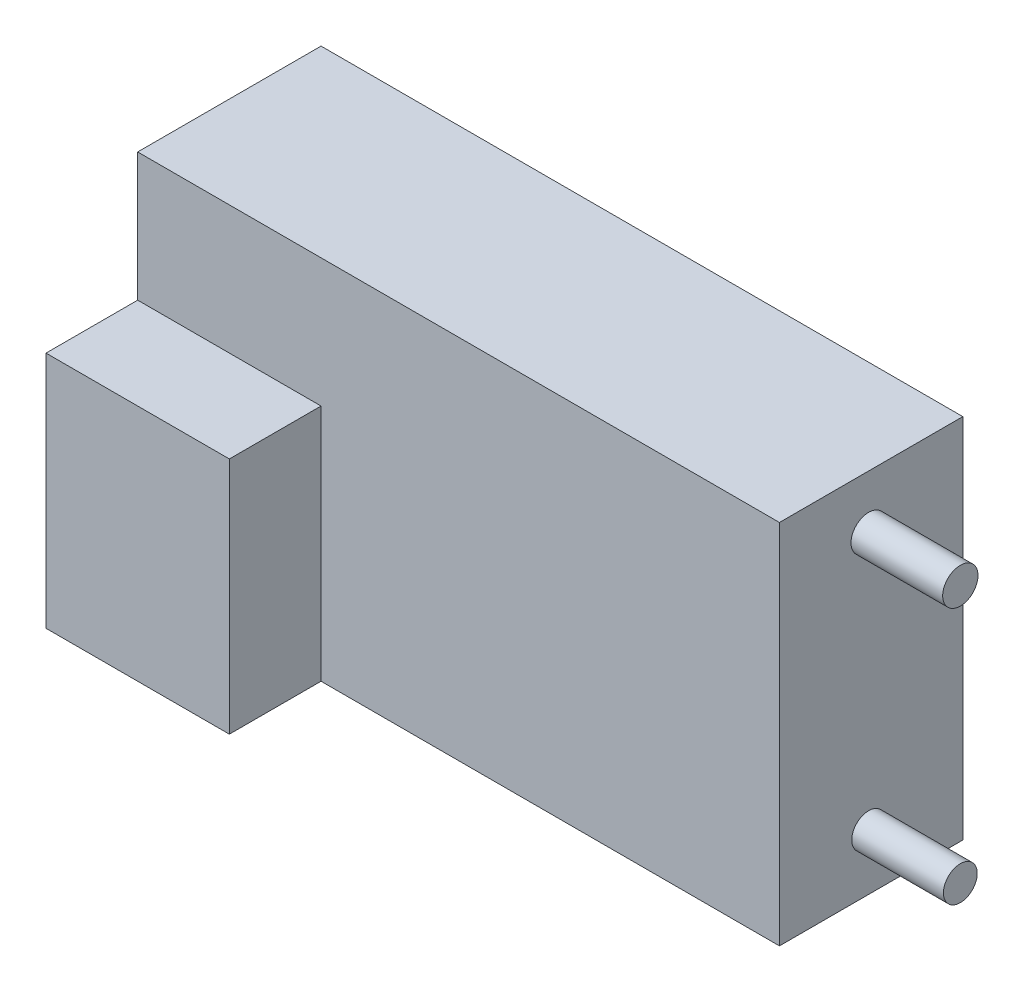
ISO-10303-21;
HEADER;
FILE_DESCRIPTION(('STEP AP214'),'2;1');
FILE_NAME('part.step','',(''),(''),'','','');
FILE_SCHEMA(('AUTOMOTIVE_DESIGN { 1 0 10303 214 1 1 1 1 }'));
ENDSEC;
DATA;
#1=APPLICATION_CONTEXT('core data for automotive mechanical design processes');
#2=APPLICATION_PROTOCOL_DEFINITION('international standard','automotive_design',2000,#1);
#3=PRODUCT_CONTEXT('',#1,'mechanical');
#4=PRODUCT('Part','Part','',(#3));
#5=PRODUCT_RELATED_PRODUCT_CATEGORY('part','',(#4));
#6=PRODUCT_DEFINITION_FORMATION('','',#4);
#7=PRODUCT_DEFINITION_CONTEXT('part definition',#1,'design');
#8=PRODUCT_DEFINITION('design','',#6,#7);
#9=PRODUCT_DEFINITION_SHAPE('','',#8);
#10=(LENGTH_UNIT() NAMED_UNIT(*) SI_UNIT(.MILLI.,.METRE.));
#11=(NAMED_UNIT(*) PLANE_ANGLE_UNIT() SI_UNIT($,.RADIAN.));
#12=(NAMED_UNIT(*) SI_UNIT($,.STERADIAN.) SOLID_ANGLE_UNIT());
#13=UNCERTAINTY_MEASURE_WITH_UNIT(LENGTH_MEASURE(1.E-05),#10,'distance_accuracy_value','');
#14=(GEOMETRIC_REPRESENTATION_CONTEXT(3) GLOBAL_UNCERTAINTY_ASSIGNED_CONTEXT((#13)) GLOBAL_UNIT_ASSIGNED_CONTEXT((#10,
#11,#12)) REPRESENTATION_CONTEXT('',''));
#15=CARTESIAN_POINT('',(0.,0.,0.));
#16=DIRECTION('',(0.,0.,1.));
#17=DIRECTION('',(1.,0.,0.));
#18=AXIS2_PLACEMENT_3D('',#15,#16,#17);
#19=CARTESIAN_POINT('',(18.7257098679594,10.6667758903759,10.));
#20=DIRECTION('',(-1.,0.,0.));
#21=DIRECTION('',(0.,-1.,0.));
#22=AXIS2_PLACEMENT_3D('',#19,#20,#21);
#23=PLANE('',#22);
#24=CARTESIAN_POINT('',(18.7257098679594,-6.30116980363482,5.13508620954894));
#25=DIRECTION('',(-1.,0.,0.));
#26=DIRECTION('',(0.,-1.,0.));
#27=AXIS2_PLACEMENT_3D('',#24,#25,#26);
#28=CIRCLE('',#27,0.92212142849435);
#29=CARTESIAN_POINT('',(18.7257098679594,-7.22329123212917,5.13508620954894));
#30=VERTEX_POINT('',#29);
#31=EDGE_CURVE('E45',#30,#30,#28,.F.);
#32=ORIENTED_EDGE('',*,*,#31,.F.);
#33=EDGE_LOOP('',(#32));
#34=FACE_BOUND('',#33,.T.);
#35=DIRECTION('',(0.,1.,0.));
#36=VECTOR('',#35,1.);
#37=CARTESIAN_POINT('',(18.7257098679594,10.6667758903759,0.));
#38=LINE('',#37,#36);
#39=CARTESIAN_POINT('',(18.7257098679594,-9.33322410962413,0.));
#40=VERTEX_POINT('',#39);
#41=CARTESIAN_POINT('',(18.7257098679594,10.6667758903759,0.));
#42=VERTEX_POINT('',#41);
#43=EDGE_CURVE('E152',#40,#42,#38,.T.);
#44=ORIENTED_EDGE('',*,*,#43,.T.);
#45=DIRECTION('',(0.,0.,-1.));
#46=VECTOR('',#45,1.);
#47=CARTESIAN_POINT('',(18.7257098679594,10.6667758903759,10.));
#48=LINE('',#47,#46);
#49=CARTESIAN_POINT('',(18.7257098679594,10.6667758903759,10.));
#50=VERTEX_POINT('',#49);
#51=EDGE_CURVE('E284',#50,#42,#48,.T.);
#52=ORIENTED_EDGE('',*,*,#51,.F.);
#53=DIRECTION('',(0.,1.,0.));
#54=VECTOR('',#53,1.);
#55=CARTESIAN_POINT('',(18.7257098679594,10.6667758903759,10.));
#56=LINE('',#55,#54);
#57=CARTESIAN_POINT('',(18.7257098679594,-9.33322410962413,10.));
#58=VERTEX_POINT('',#57);
#59=EDGE_CURVE('E303',#58,#50,#56,.T.);
#60=ORIENTED_EDGE('',*,*,#59,.F.);
#61=DIRECTION('',(0.,0.,-1.));
#62=VECTOR('',#61,1.);
#63=CARTESIAN_POINT('',(18.7257098679594,-9.33322410962413,10.));
#64=LINE('',#63,#62);
#65=EDGE_CURVE('E105',#58,#40,#64,.T.);
#66=ORIENTED_EDGE('',*,*,#65,.T.);
#67=EDGE_LOOP('',(#44,#52,#60,#66));
#68=FACE_BOUND('',#67,.T.);
#69=CARTESIAN_POINT('',(18.7257098679594,7.75028685558255,5.13508620954894));
#70=DIRECTION('',(-1.,0.,0.));
#71=DIRECTION('',(0.,-1.,0.));
#72=AXIS2_PLACEMENT_3D('',#69,#70,#71);
#73=CIRCLE('',#72,0.963466346751914);
#74=CARTESIAN_POINT('',(18.7257098679594,6.78682050883063,5.13508620954894));
#75=VERTEX_POINT('',#74);
#76=EDGE_CURVE('E11',#75,#75,#73,.F.);
#77=ORIENTED_EDGE('',*,*,#76,.F.);
#78=EDGE_LOOP('',(#77));
#79=FACE_BOUND('',#78,.T.);
#80=ADVANCED_FACE('F37',(#34,#68,#79),#23,.F.);
#81=CARTESIAN_POINT('',(-16.2742901320406,10.6667758903759,10.));
#82=DIRECTION('',(1.,0.,0.));
#83=DIRECTION('',(0.,0.,-1.));
#84=AXIS2_PLACEMENT_3D('',#81,#82,#83);
#85=PLANE('',#84);
#86=DIRECTION('',(0.,-1.,0.));
#87=VECTOR('',#86,1.);
#88=CARTESIAN_POINT('',(-16.2742901320406,10.6667758903759,0.));
#89=LINE('',#88,#87);
#90=CARTESIAN_POINT('',(-16.2742901320406,10.6667758903759,0.));
#91=VERTEX_POINT('',#90);
#92=CARTESIAN_POINT('',(-16.2742901320406,-9.33322410962413,0.));
#93=VERTEX_POINT('',#92);
#94=EDGE_CURVE('E103',#91,#93,#89,.T.);
#95=ORIENTED_EDGE('',*,*,#94,.T.);
#96=DIRECTION('',(0.,0.,-1.));
#97=VECTOR('',#96,1.);
#98=CARTESIAN_POINT('',(-16.2742901320406,-9.33322410962413,10.));
#99=LINE('',#98,#97);
#100=CARTESIAN_POINT('',(-16.2742901320406,-9.33322410962413,15.));
#101=VERTEX_POINT('',#100);
#102=EDGE_CURVE('E96',#101,#93,#99,.T.);
#103=ORIENTED_EDGE('',*,*,#102,.F.);
#104=DIRECTION('',(0.,-1.,0.));
#105=VECTOR('',#104,1.);
#106=CARTESIAN_POINT('',(-16.2742901320406,-9.33322410962413,15.));
#107=LINE('',#106,#105);
#108=CARTESIAN_POINT('',(-16.2742901320406,3.66677589037587,15.));
#109=VERTEX_POINT('',#108);
#110=EDGE_CURVE('E100',#109,#101,#107,.T.);
#111=ORIENTED_EDGE('',*,*,#110,.F.);
#112=DIRECTION('',(0.,0.,-1.));
#113=VECTOR('',#112,1.);
#114=CARTESIAN_POINT('',(-16.2742901320406,3.66677589037587,15.));
#115=LINE('',#114,#113);
#116=CARTESIAN_POINT('',(-16.2742901320406,3.66677589037587,10.));
#117=VERTEX_POINT('',#116);
#118=EDGE_CURVE('E129',#109,#117,#115,.T.);
#119=ORIENTED_EDGE('',*,*,#118,.T.);
#120=DIRECTION('',(0.,-1.,0.));
#121=VECTOR('',#120,1.);
#122=CARTESIAN_POINT('',(-16.2742901320406,10.6667758903759,10.));
#123=LINE('',#122,#121);
#124=CARTESIAN_POINT('',(-16.2742901320406,10.6667758903759,10.));
#125=VERTEX_POINT('',#124);
#126=EDGE_CURVE('E58',#125,#117,#123,.T.);
#127=ORIENTED_EDGE('',*,*,#126,.F.);
#128=DIRECTION('',(0.,0.,-1.));
#129=VECTOR('',#128,1.);
#130=CARTESIAN_POINT('',(-16.2742901320406,10.6667758903759,10.));
#131=LINE('',#130,#129);
#132=EDGE_CURVE('E283',#125,#91,#131,.T.);
#133=ORIENTED_EDGE('',*,*,#132,.T.);
#134=EDGE_LOOP('',(#95,#103,#111,#119,#127,#133));
#135=FACE_BOUND('',#134,.T.);
#136=ADVANCED_FACE('F39',(#135),#85,.F.);
#137=CARTESIAN_POINT('',(-16.2742901320406,-9.33322410962413,10.));
#138=DIRECTION('',(0.,1.,0.));
#139=DIRECTION('',(0.,0.,1.));
#140=AXIS2_PLACEMENT_3D('',#137,#138,#139);
#141=PLANE('',#140);
#142=DIRECTION('',(1.,0.,0.));
#143=VECTOR('',#142,1.);
#144=CARTESIAN_POINT('',(-16.2742901320406,-9.33322410962413,0.));
#145=LINE('',#144,#143);
#146=EDGE_CURVE('E288',#93,#40,#145,.T.);
#147=ORIENTED_EDGE('',*,*,#146,.T.);
#148=ORIENTED_EDGE('',*,*,#65,.F.);
#149=DIRECTION('',(1.,0.,0.));
#150=VECTOR('',#149,1.);
#151=CARTESIAN_POINT('',(-16.2742901320406,-9.33322410962413,10.));
#152=LINE('',#151,#150);
#153=CARTESIAN_POINT('',(-6.27429013204058,-9.33322410962413,10.));
#154=VERTEX_POINT('',#153);
#155=EDGE_CURVE('E298',#154,#58,#152,.T.);
#156=ORIENTED_EDGE('',*,*,#155,.F.);
#157=DIRECTION('',(0.,0.,-1.));
#158=VECTOR('',#157,1.);
#159=CARTESIAN_POINT('',(-6.27429013204058,-9.33322410962413,15.));
#160=LINE('',#159,#158);
#161=CARTESIAN_POINT('',(-6.27429013204058,-9.33322410962413,15.));
#162=VERTEX_POINT('',#161);
#163=EDGE_CURVE('E111',#162,#154,#160,.T.);
#164=ORIENTED_EDGE('',*,*,#163,.F.);
#165=DIRECTION('',(1.,0.,0.));
#166=VECTOR('',#165,1.);
#167=CARTESIAN_POINT('',(-16.2742901320406,-9.33322410962413,15.));
#168=LINE('',#167,#166);
#169=EDGE_CURVE('E108',#101,#162,#168,.T.);
#170=ORIENTED_EDGE('',*,*,#169,.F.);
#171=ORIENTED_EDGE('',*,*,#102,.T.);
#172=EDGE_LOOP('',(#147,#148,#156,#164,#170,#171));
#173=FACE_BOUND('',#172,.T.);
#174=ADVANCED_FACE('F109',(#173),#141,.F.);
#175=CARTESIAN_POINT('',(-16.2742901320406,10.6667758903759,10.));
#176=DIRECTION('',(0.,-1.,0.));
#177=DIRECTION('',(0.,0.,-1.));
#178=AXIS2_PLACEMENT_3D('',#175,#176,#177);
#179=PLANE('',#178);
#180=DIRECTION('',(-1.,0.,0.));
#181=VECTOR('',#180,1.);
#182=CARTESIAN_POINT('',(-16.2742901320406,10.6667758903759,0.));
#183=LINE('',#182,#181);
#184=EDGE_CURVE('E281',#42,#91,#183,.T.);
#185=ORIENTED_EDGE('',*,*,#184,.T.);
#186=ORIENTED_EDGE('',*,*,#132,.F.);
#187=DIRECTION('',(-1.,0.,0.));
#188=VECTOR('',#187,1.);
#189=CARTESIAN_POINT('',(-16.2742901320406,10.6667758903759,10.));
#190=LINE('',#189,#188);
#191=EDGE_CURVE('E286',#50,#125,#190,.T.);
#192=ORIENTED_EDGE('',*,*,#191,.F.);
#193=ORIENTED_EDGE('',*,*,#51,.T.);
#194=EDGE_LOOP('',(#185,#186,#192,#193));
#195=FACE_BOUND('',#194,.T.);
#196=ADVANCED_FACE('F189',(#195),#179,.F.);
#197=CARTESIAN_POINT('',(0.,0.,10.));
#198=DIRECTION('',(0.,0.,1.));
#199=DIRECTION('',(1.,0.,0.));
#200=AXIS2_PLACEMENT_3D('',#197,#198,#199);
#201=PLANE('',#200);
#202=DIRECTION('',(-1.,0.,0.));
#203=VECTOR('',#202,1.);
#204=CARTESIAN_POINT('',(-16.2742901320406,3.66677589037587,10.));
#205=LINE('',#204,#203);
#206=CARTESIAN_POINT('',(-6.27429013204058,3.66677589037587,10.));
#207=VERTEX_POINT('',#206);
#208=EDGE_CURVE('E120',#207,#117,#205,.T.);
#209=ORIENTED_EDGE('',*,*,#208,.F.);
#210=DIRECTION('',(0.,1.,0.));
#211=VECTOR('',#210,1.);
#212=CARTESIAN_POINT('',(-6.27429013204058,-9.33322410962413,10.));
#213=LINE('',#212,#211);
#214=EDGE_CURVE('E52',#154,#207,#213,.T.);
#215=ORIENTED_EDGE('',*,*,#214,.F.);
#216=ORIENTED_EDGE('',*,*,#155,.T.);
#217=ORIENTED_EDGE('',*,*,#59,.T.);
#218=ORIENTED_EDGE('',*,*,#191,.T.);
#219=ORIENTED_EDGE('',*,*,#126,.T.);
#220=EDGE_LOOP('',(#209,#215,#216,#217,#218,#219));
#221=FACE_BOUND('',#220,.T.);
#222=ADVANCED_FACE('F186',(#221),#201,.T.);
#223=CARTESIAN_POINT('',(0.,0.,0.));
#224=DIRECTION('',(0.,0.,1.));
#225=DIRECTION('',(1.,0.,0.));
#226=AXIS2_PLACEMENT_3D('',#223,#224,#225);
#227=PLANE('',#226);
#228=ORIENTED_EDGE('',*,*,#94,.F.);
#229=ORIENTED_EDGE('',*,*,#184,.F.);
#230=ORIENTED_EDGE('',*,*,#43,.F.);
#231=ORIENTED_EDGE('',*,*,#146,.F.);
#232=EDGE_LOOP('',(#228,#229,#230,#231));
#233=FACE_BOUND('',#232,.T.);
#234=ADVANCED_FACE('F184',(#233),#227,.F.);
#235=CARTESIAN_POINT('',(-6.27429013204058,-9.33322410962413,15.));
#236=DIRECTION('',(-1.,0.,0.));
#237=DIRECTION('',(0.,0.,1.));
#238=AXIS2_PLACEMENT_3D('',#235,#236,#237);
#239=PLANE('',#238);
#240=ORIENTED_EDGE('',*,*,#214,.T.);
#241=DIRECTION('',(0.,0.,-1.));
#242=VECTOR('',#241,1.);
#243=CARTESIAN_POINT('',(-6.27429013204058,3.66677589037587,15.));
#244=LINE('',#243,#242);
#245=CARTESIAN_POINT('',(-6.27429013204058,3.66677589037587,15.));
#246=VERTEX_POINT('',#245);
#247=EDGE_CURVE('E132',#246,#207,#244,.T.);
#248=ORIENTED_EDGE('',*,*,#247,.F.);
#249=DIRECTION('',(0.,1.,0.));
#250=VECTOR('',#249,1.);
#251=CARTESIAN_POINT('',(-6.27429013204058,-9.33322410962413,15.));
#252=LINE('',#251,#250);
#253=EDGE_CURVE('E114',#162,#246,#252,.T.);
#254=ORIENTED_EDGE('',*,*,#253,.F.);
#255=ORIENTED_EDGE('',*,*,#163,.T.);
#256=EDGE_LOOP('',(#240,#248,#254,#255));
#257=FACE_BOUND('',#256,.T.);
#258=ADVANCED_FACE('F180',(#257),#239,.F.);
#259=CARTESIAN_POINT('',(-16.2742901320406,3.66677589037587,15.));
#260=DIRECTION('',(0.,-1.,0.));
#261=DIRECTION('',(0.,0.,-1.));
#262=AXIS2_PLACEMENT_3D('',#259,#260,#261);
#263=PLANE('',#262);
#264=ORIENTED_EDGE('',*,*,#208,.T.);
#265=ORIENTED_EDGE('',*,*,#118,.F.);
#266=DIRECTION('',(-1.,0.,0.));
#267=VECTOR('',#266,1.);
#268=CARTESIAN_POINT('',(-16.2742901320406,3.66677589037587,15.));
#269=LINE('',#268,#267);
#270=EDGE_CURVE('E118',#246,#109,#269,.T.);
#271=ORIENTED_EDGE('',*,*,#270,.F.);
#272=ORIENTED_EDGE('',*,*,#247,.T.);
#273=EDGE_LOOP('',(#264,#265,#271,#272));
#274=FACE_BOUND('',#273,.T.);
#275=ADVANCED_FACE('F177',(#274),#263,.F.);
#276=CARTESIAN_POINT('',(0.,0.,15.));
#277=DIRECTION('',(0.,0.,-1.));
#278=DIRECTION('',(-1.,0.,0.));
#279=AXIS2_PLACEMENT_3D('',#276,#277,#278);
#280=PLANE('',#279);
#281=ORIENTED_EDGE('',*,*,#110,.T.);
#282=ORIENTED_EDGE('',*,*,#169,.T.);
#283=ORIENTED_EDGE('',*,*,#253,.T.);
#284=ORIENTED_EDGE('',*,*,#270,.T.);
#285=EDGE_LOOP('',(#281,#282,#283,#284));
#286=FACE_BOUND('',#285,.T.);
#287=ADVANCED_FACE('F116',(#286),#280,.F.);
#288=CARTESIAN_POINT('',(23.7257098679594,-6.30116980363482,5.13508620954894));
#289=DIRECTION('',(-1.,0.,0.));
#290=DIRECTION('',(0.,-1.,0.));
#291=AXIS2_PLACEMENT_3D('',#288,#289,#290);
#292=CYLINDRICAL_SURFACE('',#291,0.92212142849435);
#293=CARTESIAN_POINT('',(23.7257098679594,-6.30116980363482,5.13508620954894));
#294=DIRECTION('',(1.,0.,0.));
#295=DIRECTION('',(0.,1.,0.));
#296=AXIS2_PLACEMENT_3D('',#293,#294,#295);
#297=CIRCLE('',#296,0.92212142849435);
#298=CARTESIAN_POINT('',(23.7257098679594,-5.37904837514047,5.13508620954894));
#299=VERTEX_POINT('',#298);
#300=EDGE_CURVE('E124',#299,#299,#297,.T.);
#301=ORIENTED_EDGE('',*,*,#300,.F.);
#302=EDGE_LOOP('',(#301));
#303=FACE_BOUND('',#302,.T.);
#304=ORIENTED_EDGE('',*,*,#31,.T.);
#305=EDGE_LOOP('',(#304));
#306=FACE_BOUND('',#305,.T.);
#307=ADVANCED_FACE('F143',(#303,#306),#292,.T.);
#308=CARTESIAN_POINT('',(23.7257098679594,-6.30116980363482,5.13508620954894));
#309=DIRECTION('',(1.,0.,0.));
#310=DIRECTION('',(0.,1.,0.));
#311=AXIS2_PLACEMENT_3D('',#308,#309,#310);
#312=PLANE('',#311);
#313=ORIENTED_EDGE('',*,*,#300,.T.);
#314=EDGE_LOOP('',(#313));
#315=FACE_BOUND('',#314,.T.);
#316=ADVANCED_FACE('F159',(#315),#312,.T.);
#317=CARTESIAN_POINT('',(23.7257098679594,7.75028685558255,5.13508620954894));
#318=DIRECTION('',(-1.,0.,0.));
#319=DIRECTION('',(0.,-1.,0.));
#320=AXIS2_PLACEMENT_3D('',#317,#318,#319);
#321=CYLINDRICAL_SURFACE('',#320,0.963466346751914);
#322=CARTESIAN_POINT('',(23.7257098679594,7.75028685558255,5.13508620954894));
#323=DIRECTION('',(1.,0.,0.));
#324=DIRECTION('',(0.,1.,0.));
#325=AXIS2_PLACEMENT_3D('',#322,#323,#324);
#326=CIRCLE('',#325,0.963466346751914);
#327=CARTESIAN_POINT('',(23.7257098679594,8.71375320233446,5.13508620954894));
#328=VERTEX_POINT('',#327);
#329=EDGE_CURVE('E309',#328,#328,#326,.T.);
#330=ORIENTED_EDGE('',*,*,#329,.F.);
#331=EDGE_LOOP('',(#330));
#332=FACE_BOUND('',#331,.T.);
#333=ORIENTED_EDGE('',*,*,#76,.T.);
#334=EDGE_LOOP('',(#333));
#335=FACE_BOUND('',#334,.T.);
#336=ADVANCED_FACE('F156',(#332,#335),#321,.T.);
#337=CARTESIAN_POINT('',(23.7257098679594,7.75028685558255,5.13508620954894));
#338=DIRECTION('',(1.,0.,0.));
#339=DIRECTION('',(0.,1.,0.));
#340=AXIS2_PLACEMENT_3D('',#337,#338,#339);
#341=PLANE('',#340);
#342=ORIENTED_EDGE('',*,*,#329,.T.);
#343=EDGE_LOOP('',(#342));
#344=FACE_BOUND('',#343,.T.);
#345=ADVANCED_FACE('F158',(#344),#341,.T.);
#346=CLOSED_SHELL('',(#80,#136,#174,#196,#222,#234,#258,#275,#287,#307,#316,#336,#345));
#347=MANIFOLD_SOLID_BREP('B2',#346);
#348=ADVANCED_BREP_SHAPE_REPRESENTATION('',(#18,#347),#14);
#349=SHAPE_DEFINITION_REPRESENTATION(#9,#348);
ENDSEC;
END-ISO-10303-21;
